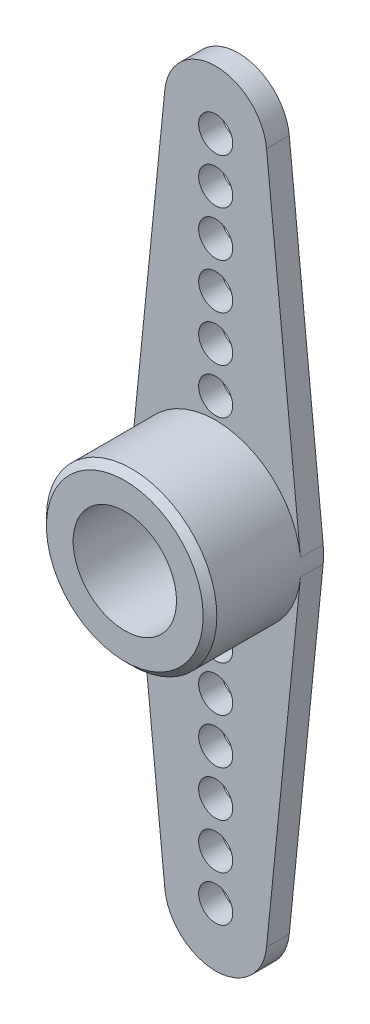
ISO-10303-21;
HEADER;
FILE_DESCRIPTION(('STEP AP214'),'2;1');
FILE_NAME('part.step','',(''),(''),'','','');
FILE_SCHEMA(('AUTOMOTIVE_DESIGN { 1 0 10303 214 1 1 1 1 }'));
ENDSEC;
DATA;
#1=APPLICATION_CONTEXT('core data for automotive mechanical design processes');
#2=APPLICATION_PROTOCOL_DEFINITION('international standard','automotive_design',2000,#1);
#3=PRODUCT_CONTEXT('',#1,'mechanical');
#4=PRODUCT('Part','Part','',(#3));
#5=PRODUCT_RELATED_PRODUCT_CATEGORY('part','',(#4));
#6=PRODUCT_DEFINITION_FORMATION('','',#4);
#7=PRODUCT_DEFINITION_CONTEXT('part definition',#1,'design');
#8=PRODUCT_DEFINITION('design','',#6,#7);
#9=PRODUCT_DEFINITION_SHAPE('','',#8);
#10=(LENGTH_UNIT() NAMED_UNIT(*) SI_UNIT(.MILLI.,.METRE.));
#11=(NAMED_UNIT(*) PLANE_ANGLE_UNIT() SI_UNIT($,.RADIAN.));
#12=(NAMED_UNIT(*) SI_UNIT($,.STERADIAN.) SOLID_ANGLE_UNIT());
#13=UNCERTAINTY_MEASURE_WITH_UNIT(LENGTH_MEASURE(1.E-05),#10,'distance_accuracy_value','');
#14=(GEOMETRIC_REPRESENTATION_CONTEXT(3) GLOBAL_UNCERTAINTY_ASSIGNED_CONTEXT((#13)) GLOBAL_UNIT_ASSIGNED_CONTEXT((#10,
#11,#12)) REPRESENTATION_CONTEXT('',''));
#15=CARTESIAN_POINT('',(0.,0.,0.));
#16=DIRECTION('',(0.,0.,1.));
#17=DIRECTION('',(1.,0.,0.));
#18=AXIS2_PLACEMENT_3D('',#15,#16,#17);
#19=CARTESIAN_POINT('',(0.,15.,1.));
#20=DIRECTION('',(0.,0.,-1.));
#21=DIRECTION('',(-1.,0.,0.));
#22=AXIS2_PLACEMENT_3D('',#19,#20,#21);
#23=CYLINDRICAL_SURFACE('',#22,2.25);
#24=CARTESIAN_POINT('',(0.,15.,0.));
#25=DIRECTION('',(0.,0.,1.));
#26=DIRECTION('',(1.,0.,0.));
#27=AXIS2_PLACEMENT_3D('',#24,#25,#26);
#28=CIRCLE('',#27,2.25);
#29=CARTESIAN_POINT('',(2.23872173348989,15.225,0.));
#30=VERTEX_POINT('',#29);
#31=CARTESIAN_POINT('',(-2.23872173348989,15.225,0.));
#32=VERTEX_POINT('',#31);
#33=EDGE_CURVE('E219',#30,#32,#28,.T.);
#34=ORIENTED_EDGE('',*,*,#33,.T.);
#35=DIRECTION('',(0.,0.,-1.));
#36=VECTOR('',#35,1.);
#37=CARTESIAN_POINT('',(-2.23872173348989,15.225,1.));
#38=LINE('',#37,#36);
#39=CARTESIAN_POINT('',(-2.23872173348989,15.225,1.));
#40=VERTEX_POINT('',#39);
#41=EDGE_CURVE('E225',#40,#32,#38,.T.);
#42=ORIENTED_EDGE('',*,*,#41,.F.);
#43=CARTESIAN_POINT('',(0.,15.,1.));
#44=DIRECTION('',(0.,0.,1.));
#45=DIRECTION('',(1.,0.,0.));
#46=AXIS2_PLACEMENT_3D('',#43,#44,#45);
#47=CIRCLE('',#46,2.25);
#48=CARTESIAN_POINT('',(2.23872173348989,15.225,1.));
#49=VERTEX_POINT('',#48);
#50=EDGE_CURVE('E220',#49,#40,#47,.T.);
#51=ORIENTED_EDGE('',*,*,#50,.F.);
#52=DIRECTION('',(0.,0.,-1.));
#53=VECTOR('',#52,1.);
#54=CARTESIAN_POINT('',(2.23872173348989,15.225,1.));
#55=LINE('',#54,#53);
#56=EDGE_CURVE('E228',#49,#30,#55,.T.);
#57=ORIENTED_EDGE('',*,*,#56,.T.);
#58=EDGE_LOOP('',(#34,#42,#51,#57));
#59=FACE_BOUND('',#58,.T.);
#60=ADVANCED_FACE('F37',(#59),#23,.T.);
#61=CARTESIAN_POINT('',(-2.23872173348989,15.225,1.));
#62=DIRECTION('',(0.99498743710662,-0.1,0.));
#63=DIRECTION('',(0.1,0.99498743710662,0.));
#64=AXIS2_PLACEMENT_3D('',#61,#62,#63);
#65=PLANE('',#64);
#66=DIRECTION('',(-0.1,-0.99498743710662,0.));
#67=VECTOR('',#66,1.);
#68=CARTESIAN_POINT('',(-2.23872173348989,15.225,0.));
#69=LINE('',#68,#67);
#70=CARTESIAN_POINT('',(-3.73120288914983,0.375,0.));
#71=VERTEX_POINT('',#70);
#72=EDGE_CURVE('E248',#32,#71,#69,.T.);
#73=ORIENTED_EDGE('',*,*,#72,.T.);
#74=DIRECTION('',(0.,0.,-1.));
#75=VECTOR('',#74,1.);
#76=CARTESIAN_POINT('',(-3.73120288914983,0.375,1.));
#77=LINE('',#76,#75);
#78=CARTESIAN_POINT('',(-3.73120288914983,0.375,1.));
#79=VERTEX_POINT('',#78);
#80=EDGE_CURVE('E233',#79,#71,#77,.T.);
#81=ORIENTED_EDGE('',*,*,#80,.F.);
#82=DIRECTION('',(-0.1,-0.99498743710662,0.));
#83=VECTOR('',#82,1.);
#84=CARTESIAN_POINT('',(-2.23872173348989,15.225,1.));
#85=LINE('',#84,#83);
#86=EDGE_CURVE('E84',#40,#79,#85,.T.);
#87=ORIENTED_EDGE('',*,*,#86,.F.);
#88=ORIENTED_EDGE('',*,*,#41,.T.);
#89=EDGE_LOOP('',(#73,#81,#87,#88));
#90=FACE_BOUND('',#89,.T.);
#91=ADVANCED_FACE('F247',(#90),#65,.F.);
#92=CARTESIAN_POINT('',(0.,0.,1.));
#93=DIRECTION('',(0.,0.,-1.));
#94=DIRECTION('',(-1.,0.,0.));
#95=AXIS2_PLACEMENT_3D('',#92,#93,#94);
#96=CYLINDRICAL_SURFACE('',#95,3.75);
#97=CARTESIAN_POINT('',(0.,0.,4.7));
#98=DIRECTION('',(0.,0.,1.));
#99=DIRECTION('',(1.,0.,0.));
#100=AXIS2_PLACEMENT_3D('',#97,#98,#99);
#101=CIRCLE('',#100,3.75);
#102=CARTESIAN_POINT('',(3.75,0.,4.7));
#103=VERTEX_POINT('',#102);
#104=EDGE_CURVE('E11',#103,#103,#101,.F.);
#105=ORIENTED_EDGE('',*,*,#104,.T.);
#106=EDGE_LOOP('',(#105));
#107=FACE_BOUND('',#106,.T.);
#108=CARTESIAN_POINT('',(0.,0.,0.));
#109=DIRECTION('',(0.,0.,1.));
#110=DIRECTION('',(1.,0.,0.));
#111=AXIS2_PLACEMENT_3D('',#108,#109,#110);
#112=CIRCLE('',#111,3.75);
#113=CARTESIAN_POINT('',(-3.73120288914983,-0.375,0.));
#114=VERTEX_POINT('',#113);
#115=EDGE_CURVE('E255',#71,#114,#112,.T.);
#116=ORIENTED_EDGE('',*,*,#115,.T.);
#117=DIRECTION('',(0.,0.,-1.));
#118=VECTOR('',#117,1.);
#119=CARTESIAN_POINT('',(-3.73120288914983,-0.375,1.));
#120=LINE('',#119,#118);
#121=CARTESIAN_POINT('',(-3.73120288914983,-0.375,1.));
#122=VERTEX_POINT('',#121);
#123=EDGE_CURVE('E129',#122,#114,#120,.T.);
#124=ORIENTED_EDGE('',*,*,#123,.F.);
#125=CARTESIAN_POINT('',(0.,0.,1.));
#126=DIRECTION('',(0.,0.,-1.));
#127=DIRECTION('',(1.,0.,0.));
#128=AXIS2_PLACEMENT_3D('',#125,#126,#127);
#129=CIRCLE('',#128,3.75);
#130=CARTESIAN_POINT('',(3.73120288914983,-0.375,1.));
#131=VERTEX_POINT('',#130);
#132=EDGE_CURVE('E115',#131,#122,#129,.T.);
#133=ORIENTED_EDGE('',*,*,#132,.F.);
#134=DIRECTION('',(0.,0.,-1.));
#135=VECTOR('',#134,1.);
#136=CARTESIAN_POINT('',(3.73120288914983,-0.375,1.));
#137=LINE('',#136,#135);
#138=CARTESIAN_POINT('',(3.73120288914983,-0.375,0.));
#139=VERTEX_POINT('',#138);
#140=EDGE_CURVE('E126',#131,#139,#137,.T.);
#141=ORIENTED_EDGE('',*,*,#140,.T.);
#142=CARTESIAN_POINT('',(3.73120288914983,0.375,0.));
#143=VERTEX_POINT('',#142);
#144=EDGE_CURVE('E73',#139,#143,#112,.T.);
#145=ORIENTED_EDGE('',*,*,#144,.T.);
#146=DIRECTION('',(0.,0.,-1.));
#147=VECTOR('',#146,1.);
#148=CARTESIAN_POINT('',(3.73120288914983,0.375,1.));
#149=LINE('',#148,#147);
#150=CARTESIAN_POINT('',(3.73120288914983,0.375,1.));
#151=VERTEX_POINT('',#150);
#152=EDGE_CURVE('E231',#151,#143,#149,.T.);
#153=ORIENTED_EDGE('',*,*,#152,.F.);
#154=CARTESIAN_POINT('',(0.,0.,1.));
#155=DIRECTION('',(0.,0.,1.));
#156=DIRECTION('',(1.,0.,0.));
#157=AXIS2_PLACEMENT_3D('',#154,#155,#156);
#158=CIRCLE('',#157,3.75);
#159=EDGE_CURVE('E213',#151,#79,#158,.T.);
#160=ORIENTED_EDGE('',*,*,#159,.T.);
#161=ORIENTED_EDGE('',*,*,#80,.T.);
#162=EDGE_LOOP('',(#116,#124,#133,#141,#145,#153,#160,#161));
#163=FACE_BOUND('',#162,.T.);
#164=ADVANCED_FACE('F131',(#107,#163),#96,.T.);
#165=CARTESIAN_POINT('',(2.23872173348989,15.225,1.));
#166=DIRECTION('',(-0.99498743710662,-0.1,0.));
#167=DIRECTION('',(0.1,-0.99498743710662,0.));
#168=AXIS2_PLACEMENT_3D('',#165,#166,#167);
#169=PLANE('',#168);
#170=DIRECTION('',(-0.1,0.99498743710662,0.));
#171=VECTOR('',#170,1.);
#172=CARTESIAN_POINT('',(2.23872173348989,15.225,0.));
#173=LINE('',#172,#171);
#174=EDGE_CURVE('E78',#143,#30,#173,.T.);
#175=ORIENTED_EDGE('',*,*,#174,.T.);
#176=ORIENTED_EDGE('',*,*,#56,.F.);
#177=DIRECTION('',(-0.1,0.99498743710662,0.));
#178=VECTOR('',#177,1.);
#179=CARTESIAN_POINT('',(2.23872173348989,15.225,1.));
#180=LINE('',#179,#178);
#181=EDGE_CURVE('E54',#151,#49,#180,.T.);
#182=ORIENTED_EDGE('',*,*,#181,.F.);
#183=ORIENTED_EDGE('',*,*,#152,.T.);
#184=EDGE_LOOP('',(#175,#176,#182,#183));
#185=FACE_BOUND('',#184,.T.);
#186=ADVANCED_FACE('F259',(#185),#169,.F.);
#187=CARTESIAN_POINT('',(0.,15.,1.));
#188=DIRECTION('',(0.,0.,1.));
#189=DIRECTION('',(1.,0.,0.));
#190=AXIS2_PLACEMENT_3D('',#187,#188,#189);
#191=PLANE('',#190);
#192=CARTESIAN_POINT('',(0.,14.6722294535393,1.));
#193=DIRECTION('',(0.,0.,1.));
#194=DIRECTION('',(1.,0.,0.));
#195=AXIS2_PLACEMENT_3D('',#192,#193,#194);
#196=CIRCLE('',#195,0.75);
#197=CARTESIAN_POINT('',(0.750000000000035,14.6722294535393,1.));
#198=VERTEX_POINT('',#197);
#199=EDGE_CURVE('E164',#198,#198,#196,.T.);
#200=ORIENTED_EDGE('',*,*,#199,.F.);
#201=EDGE_LOOP('',(#200));
#202=FACE_BOUND('',#201,.T.);
#203=CARTESIAN_POINT('',(0.,12.6722294535393,1.));
#204=DIRECTION('',(0.,0.,1.));
#205=DIRECTION('',(1.,0.,0.));
#206=AXIS2_PLACEMENT_3D('',#203,#204,#205);
#207=CIRCLE('',#206,0.75);
#208=CARTESIAN_POINT('',(0.750000000000028,12.6722294535393,1.));
#209=VERTEX_POINT('',#208);
#210=EDGE_CURVE('E170',#209,#209,#207,.T.);
#211=ORIENTED_EDGE('',*,*,#210,.F.);
#212=EDGE_LOOP('',(#211));
#213=FACE_BOUND('',#212,.T.);
#214=CARTESIAN_POINT('',(0.,10.6722294535393,1.));
#215=DIRECTION('',(0.,0.,1.));
#216=DIRECTION('',(1.,0.,0.));
#217=AXIS2_PLACEMENT_3D('',#214,#215,#216);
#218=CIRCLE('',#217,0.75);
#219=CARTESIAN_POINT('',(0.750000000000021,10.6722294535393,1.));
#220=VERTEX_POINT('',#219);
#221=EDGE_CURVE('E176',#220,#220,#218,.T.);
#222=ORIENTED_EDGE('',*,*,#221,.F.);
#223=EDGE_LOOP('',(#222));
#224=FACE_BOUND('',#223,.T.);
#225=CARTESIAN_POINT('',(0.,8.6722294535393,1.));
#226=DIRECTION('',(0.,0.,1.));
#227=DIRECTION('',(1.,0.,0.));
#228=AXIS2_PLACEMENT_3D('',#225,#226,#227);
#229=CIRCLE('',#228,0.75);
#230=CARTESIAN_POINT('',(0.750000000000014,8.6722294535393,1.));
#231=VERTEX_POINT('',#230);
#232=EDGE_CURVE('E182',#231,#231,#229,.T.);
#233=ORIENTED_EDGE('',*,*,#232,.F.);
#234=EDGE_LOOP('',(#233));
#235=FACE_BOUND('',#234,.T.);
#236=CARTESIAN_POINT('',(0.,6.6722294535393,1.));
#237=DIRECTION('',(0.,0.,1.));
#238=DIRECTION('',(1.,0.,0.));
#239=AXIS2_PLACEMENT_3D('',#236,#237,#238);
#240=CIRCLE('',#239,0.75);
#241=CARTESIAN_POINT('',(0.750000000000007,6.6722294535393,1.));
#242=VERTEX_POINT('',#241);
#243=EDGE_CURVE('E188',#242,#242,#240,.T.);
#244=ORIENTED_EDGE('',*,*,#243,.F.);
#245=EDGE_LOOP('',(#244));
#246=FACE_BOUND('',#245,.T.);
#247=CARTESIAN_POINT('',(0.,4.6722294535393,1.));
#248=DIRECTION('',(0.,0.,1.));
#249=DIRECTION('',(1.,0.,0.));
#250=AXIS2_PLACEMENT_3D('',#247,#248,#249);
#251=CIRCLE('',#250,0.75);
#252=CARTESIAN_POINT('',(0.75,4.6722294535393,1.));
#253=VERTEX_POINT('',#252);
#254=EDGE_CURVE('E194',#253,#253,#251,.T.);
#255=ORIENTED_EDGE('',*,*,#254,.F.);
#256=EDGE_LOOP('',(#255));
#257=FACE_BOUND('',#256,.T.);
#258=ORIENTED_EDGE('',*,*,#159,.F.);
#259=ORIENTED_EDGE('',*,*,#181,.T.);
#260=ORIENTED_EDGE('',*,*,#50,.T.);
#261=ORIENTED_EDGE('',*,*,#86,.T.);
#262=EDGE_LOOP('',(#258,#259,#260,#261));
#263=FACE_BOUND('',#262,.T.);
#264=ADVANCED_FACE('F257',(#202,#213,#224,#235,#246,#257,#263),#191,.T.);
#265=CARTESIAN_POINT('',(0.,15.,0.));
#266=DIRECTION('',(0.,0.,1.));
#267=DIRECTION('',(1.,0.,0.));
#268=AXIS2_PLACEMENT_3D('',#265,#266,#267);
#269=PLANE('',#268);
#270=CARTESIAN_POINT('',(0.,0.,0.));
#271=DIRECTION('',(0.,0.,-1.));
#272=DIRECTION('',(-1.,0.,0.));
#273=AXIS2_PLACEMENT_3D('',#270,#271,#272);
#274=CIRCLE('',#273,2.);
#275=CARTESIAN_POINT('',(-2.,0.,0.));
#276=VERTEX_POINT('',#275);
#277=EDGE_CURVE('E203',#276,#276,#274,.T.);
#278=ORIENTED_EDGE('',*,*,#277,.F.);
#279=EDGE_LOOP('',(#278));
#280=FACE_BOUND('',#279,.T.);
#281=CARTESIAN_POINT('',(0.,14.6722294535393,0.));
#282=DIRECTION('',(0.,0.,-1.));
#283=DIRECTION('',(-1.,0.,0.));
#284=AXIS2_PLACEMENT_3D('',#281,#282,#283);
#285=CIRCLE('',#284,0.75);
#286=CARTESIAN_POINT('',(-0.749999999999965,14.6722294535393,0.));
#287=VERTEX_POINT('',#286);
#288=EDGE_CURVE('E161',#287,#287,#285,.T.);
#289=ORIENTED_EDGE('',*,*,#288,.F.);
#290=EDGE_LOOP('',(#289));
#291=FACE_BOUND('',#290,.T.);
#292=CARTESIAN_POINT('',(0.,12.6722294535393,0.));
#293=DIRECTION('',(0.,0.,-1.));
#294=DIRECTION('',(-1.,0.,0.));
#295=AXIS2_PLACEMENT_3D('',#292,#293,#294);
#296=CIRCLE('',#295,0.75);
#297=CARTESIAN_POINT('',(-0.749999999999972,12.6722294535393,0.));
#298=VERTEX_POINT('',#297);
#299=EDGE_CURVE('E167',#298,#298,#296,.T.);
#300=ORIENTED_EDGE('',*,*,#299,.F.);
#301=EDGE_LOOP('',(#300));
#302=FACE_BOUND('',#301,.T.);
#303=CARTESIAN_POINT('',(0.,10.6722294535393,0.));
#304=DIRECTION('',(0.,0.,-1.));
#305=DIRECTION('',(-1.,0.,0.));
#306=AXIS2_PLACEMENT_3D('',#303,#304,#305);
#307=CIRCLE('',#306,0.75);
#308=CARTESIAN_POINT('',(-0.749999999999979,10.6722294535393,0.));
#309=VERTEX_POINT('',#308);
#310=EDGE_CURVE('E173',#309,#309,#307,.T.);
#311=ORIENTED_EDGE('',*,*,#310,.F.);
#312=EDGE_LOOP('',(#311));
#313=FACE_BOUND('',#312,.T.);
#314=CARTESIAN_POINT('',(0.,8.6722294535393,0.));
#315=DIRECTION('',(0.,0.,-1.));
#316=DIRECTION('',(-1.,0.,0.));
#317=AXIS2_PLACEMENT_3D('',#314,#315,#316);
#318=CIRCLE('',#317,0.75);
#319=CARTESIAN_POINT('',(-0.749999999999986,8.6722294535393,0.));
#320=VERTEX_POINT('',#319);
#321=EDGE_CURVE('E179',#320,#320,#318,.T.);
#322=ORIENTED_EDGE('',*,*,#321,.F.);
#323=EDGE_LOOP('',(#322));
#324=FACE_BOUND('',#323,.T.);
#325=CARTESIAN_POINT('',(0.,6.6722294535393,0.));
#326=DIRECTION('',(0.,0.,-1.));
#327=DIRECTION('',(-1.,0.,0.));
#328=AXIS2_PLACEMENT_3D('',#325,#326,#327);
#329=CIRCLE('',#328,0.75);
#330=CARTESIAN_POINT('',(-0.749999999999993,6.6722294535393,0.));
#331=VERTEX_POINT('',#330);
#332=EDGE_CURVE('E185',#331,#331,#329,.T.);
#333=ORIENTED_EDGE('',*,*,#332,.F.);
#334=EDGE_LOOP('',(#333));
#335=FACE_BOUND('',#334,.T.);
#336=CARTESIAN_POINT('',(0.,4.6722294535393,0.));
#337=DIRECTION('',(0.,0.,-1.));
#338=DIRECTION('',(-1.,0.,0.));
#339=AXIS2_PLACEMENT_3D('',#336,#337,#338);
#340=CIRCLE('',#339,0.75);
#341=CARTESIAN_POINT('',(-0.75,4.6722294535393,0.));
#342=VERTEX_POINT('',#341);
#343=EDGE_CURVE('E191',#342,#342,#340,.T.);
#344=ORIENTED_EDGE('',*,*,#343,.F.);
#345=EDGE_LOOP('',(#344));
#346=FACE_BOUND('',#345,.T.);
#347=ORIENTED_EDGE('',*,*,#144,.F.);
#348=DIRECTION('',(-0.1,-0.99498743710662,0.));
#349=VECTOR('',#348,1.);
#350=CARTESIAN_POINT('',(2.23872173348989,-15.225,0.));
#351=LINE('',#350,#349);
#352=CARTESIAN_POINT('',(2.23872173348989,-15.225,0.));
#353=VERTEX_POINT('',#352);
#354=EDGE_CURVE('E128',#139,#353,#351,.T.);
#355=ORIENTED_EDGE('',*,*,#354,.T.);
#356=CARTESIAN_POINT('',(0.,-15.,0.));
#357=DIRECTION('',(0.,0.,-1.));
#358=DIRECTION('',(1.,0.,0.));
#359=AXIS2_PLACEMENT_3D('',#356,#357,#358);
#360=CIRCLE('',#359,2.25);
#361=CARTESIAN_POINT('',(-2.23872173348989,-15.225,0.));
#362=VERTEX_POINT('',#361);
#363=EDGE_CURVE('E134',#353,#362,#360,.T.);
#364=ORIENTED_EDGE('',*,*,#363,.T.);
#365=DIRECTION('',(-0.1,0.99498743710662,0.));
#366=VECTOR('',#365,1.);
#367=CARTESIAN_POINT('',(-2.23872173348989,-15.225,0.));
#368=LINE('',#367,#366);
#369=EDGE_CURVE('E138',#362,#114,#368,.T.);
#370=ORIENTED_EDGE('',*,*,#369,.T.);
#371=ORIENTED_EDGE('',*,*,#115,.F.);
#372=ORIENTED_EDGE('',*,*,#72,.F.);
#373=ORIENTED_EDGE('',*,*,#33,.F.);
#374=ORIENTED_EDGE('',*,*,#174,.F.);
#375=EDGE_LOOP('',(#347,#355,#364,#370,#371,#372,#373,#374));
#376=FACE_BOUND('',#375,.T.);
#377=CARTESIAN_POINT('',(0.,-14.6722294535393,0.));
#378=DIRECTION('',(0.,0.,1.));
#379=DIRECTION('',(-1.,0.,0.));
#380=AXIS2_PLACEMENT_3D('',#377,#378,#379);
#381=CIRCLE('',#380,0.75);
#382=CARTESIAN_POINT('',(-0.749999999999965,-14.6722294535393,0.));
#383=VERTEX_POINT('',#382);
#384=EDGE_CURVE('E474',#383,#383,#381,.T.);
#385=ORIENTED_EDGE('',*,*,#384,.T.);
#386=EDGE_LOOP('',(#385));
#387=FACE_BOUND('',#386,.T.);
#388=CARTESIAN_POINT('',(0.,-12.6722294535393,0.));
#389=DIRECTION('',(0.,0.,1.));
#390=DIRECTION('',(-1.,0.,0.));
#391=AXIS2_PLACEMENT_3D('',#388,#389,#390);
#392=CIRCLE('',#391,0.75);
#393=CARTESIAN_POINT('',(-0.749999999999972,-12.6722294535393,0.));
#394=VERTEX_POINT('',#393);
#395=EDGE_CURVE('E476',#394,#394,#392,.T.);
#396=ORIENTED_EDGE('',*,*,#395,.T.);
#397=EDGE_LOOP('',(#396));
#398=FACE_BOUND('',#397,.T.);
#399=CARTESIAN_POINT('',(0.,-10.6722294535393,0.));
#400=DIRECTION('',(0.,0.,1.));
#401=DIRECTION('',(-1.,0.,0.));
#402=AXIS2_PLACEMENT_3D('',#399,#400,#401);
#403=CIRCLE('',#402,0.75);
#404=CARTESIAN_POINT('',(-0.749999999999979,-10.6722294535393,0.));
#405=VERTEX_POINT('',#404);
#406=EDGE_CURVE('E484',#405,#405,#403,.T.);
#407=ORIENTED_EDGE('',*,*,#406,.T.);
#408=EDGE_LOOP('',(#407));
#409=FACE_BOUND('',#408,.T.);
#410=CARTESIAN_POINT('',(0.,-8.6722294535393,0.));
#411=DIRECTION('',(0.,0.,1.));
#412=DIRECTION('',(-1.,0.,0.));
#413=AXIS2_PLACEMENT_3D('',#410,#411,#412);
#414=CIRCLE('',#413,0.75);
#415=CARTESIAN_POINT('',(-0.749999999999986,-8.6722294535393,0.));
#416=VERTEX_POINT('',#415);
#417=EDGE_CURVE('E490',#416,#416,#414,.T.);
#418=ORIENTED_EDGE('',*,*,#417,.T.);
#419=EDGE_LOOP('',(#418));
#420=FACE_BOUND('',#419,.T.);
#421=CARTESIAN_POINT('',(0.,-6.6722294535393,0.));
#422=DIRECTION('',(0.,0.,1.));
#423=DIRECTION('',(-1.,0.,0.));
#424=AXIS2_PLACEMENT_3D('',#421,#422,#423);
#425=CIRCLE('',#424,0.75);
#426=CARTESIAN_POINT('',(-0.749999999999993,-6.6722294535393,0.));
#427=VERTEX_POINT('',#426);
#428=EDGE_CURVE('E496',#427,#427,#425,.T.);
#429=ORIENTED_EDGE('',*,*,#428,.T.);
#430=EDGE_LOOP('',(#429));
#431=FACE_BOUND('',#430,.T.);
#432=CARTESIAN_POINT('',(0.,-4.6722294535393,0.));
#433=DIRECTION('',(0.,0.,1.));
#434=DIRECTION('',(-1.,0.,0.));
#435=AXIS2_PLACEMENT_3D('',#432,#433,#434);
#436=CIRCLE('',#435,0.75);
#437=CARTESIAN_POINT('',(-0.75,-4.6722294535393,0.));
#438=VERTEX_POINT('',#437);
#439=EDGE_CURVE('E141',#438,#438,#436,.T.);
#440=ORIENTED_EDGE('',*,*,#439,.T.);
#441=EDGE_LOOP('',(#440));
#442=FACE_BOUND('',#441,.T.);
#443=ADVANCED_FACE('F260',(#280,#291,#302,#313,#324,#335,#346,#376,#387,#398,#409,#420,#431,
#442),#269,.F.);
#444=CARTESIAN_POINT('',(0.,0.,5.));
#445=DIRECTION('',(0.,0.,1.));
#446=DIRECTION('',(1.,0.,0.));
#447=AXIS2_PLACEMENT_3D('',#444,#445,#446);
#448=PLANE('',#447);
#449=CARTESIAN_POINT('',(0.,0.,5.));
#450=DIRECTION('',(0.,0.,1.));
#451=DIRECTION('',(1.,0.,0.));
#452=AXIS2_PLACEMENT_3D('',#449,#450,#451);
#453=CIRCLE('',#452,3.45);
#454=CARTESIAN_POINT('',(3.45,0.,5.));
#455=VERTEX_POINT('',#454);
#456=EDGE_CURVE('E46',#455,#455,#453,.T.);
#457=ORIENTED_EDGE('',*,*,#456,.T.);
#458=EDGE_LOOP('',(#457));
#459=FACE_BOUND('',#458,.T.);
#460=CARTESIAN_POINT('',(0.,0.,5.));
#461=DIRECTION('',(0.,0.,1.));
#462=DIRECTION('',(1.,0.,0.));
#463=AXIS2_PLACEMENT_3D('',#460,#461,#462);
#464=CIRCLE('',#463,2.275);
#465=CARTESIAN_POINT('',(2.275,0.,5.));
#466=VERTEX_POINT('',#465);
#467=EDGE_CURVE('E207',#466,#466,#464,.T.);
#468=ORIENTED_EDGE('',*,*,#467,.F.);
#469=EDGE_LOOP('',(#468));
#470=FACE_BOUND('',#469,.T.);
#471=ADVANCED_FACE('F293',(#459,#470),#448,.T.);
#472=CARTESIAN_POINT('',(0.,0.,1.5));
#473=DIRECTION('',(0.,0.,1.));
#474=DIRECTION('',(1.,0.,0.));
#475=AXIS2_PLACEMENT_3D('',#472,#473,#474);
#476=CYLINDRICAL_SURFACE('',#475,2.275);
#477=CARTESIAN_POINT('',(0.,0.,1.5));
#478=DIRECTION('',(0.,0.,1.));
#479=DIRECTION('',(1.,0.,0.));
#480=AXIS2_PLACEMENT_3D('',#477,#478,#479);
#481=CIRCLE('',#480,2.275);
#482=CARTESIAN_POINT('',(2.275,0.,1.5));
#483=VERTEX_POINT('',#482);
#484=EDGE_CURVE('E210',#483,#483,#481,.T.);
#485=ORIENTED_EDGE('',*,*,#484,.F.);
#486=EDGE_LOOP('',(#485));
#487=FACE_BOUND('',#486,.T.);
#488=ORIENTED_EDGE('',*,*,#467,.T.);
#489=EDGE_LOOP('',(#488));
#490=FACE_BOUND('',#489,.T.);
#491=ADVANCED_FACE('F300',(#487,#490),#476,.F.);
#492=CARTESIAN_POINT('',(0.,0.,1.5));
#493=DIRECTION('',(0.,0.,1.));
#494=DIRECTION('',(1.,0.,0.));
#495=AXIS2_PLACEMENT_3D('',#492,#493,#494);
#496=PLANE('',#495);
#497=ORIENTED_EDGE('',*,*,#484,.T.);
#498=EDGE_LOOP('',(#497));
#499=FACE_BOUND('',#498,.T.);
#500=CARTESIAN_POINT('',(0.,0.,1.5));
#501=DIRECTION('',(0.,0.,1.));
#502=DIRECTION('',(1.,0.,0.));
#503=AXIS2_PLACEMENT_3D('',#500,#501,#502);
#504=CIRCLE('',#503,0.75);
#505=CARTESIAN_POINT('',(0.75,0.,1.5));
#506=VERTEX_POINT('',#505);
#507=EDGE_CURVE('E200',#506,#506,#504,.T.);
#508=ORIENTED_EDGE('',*,*,#507,.F.);
#509=EDGE_LOOP('',(#508));
#510=FACE_BOUND('',#509,.T.);
#511=ADVANCED_FACE('F303',(#499,#510),#496,.T.);
#512=CARTESIAN_POINT('',(0.,0.,0.8));
#513=DIRECTION('',(0.,0.,-1.));
#514=DIRECTION('',(-1.,0.,0.));
#515=AXIS2_PLACEMENT_3D('',#512,#513,#514);
#516=CYLINDRICAL_SURFACE('',#515,2.);
#517=ORIENTED_EDGE('',*,*,#277,.T.);
#518=EDGE_LOOP('',(#517));
#519=FACE_BOUND('',#518,.T.);
#520=CARTESIAN_POINT('',(0.,0.,0.8));
#521=DIRECTION('',(0.,0.,-1.));
#522=DIRECTION('',(-1.,0.,0.));
#523=AXIS2_PLACEMENT_3D('',#520,#521,#522);
#524=CIRCLE('',#523,2.);
#525=CARTESIAN_POINT('',(-2.,0.,0.8));
#526=VERTEX_POINT('',#525);
#527=EDGE_CURVE('E204',#526,#526,#524,.T.);
#528=ORIENTED_EDGE('',*,*,#527,.F.);
#529=EDGE_LOOP('',(#528));
#530=FACE_BOUND('',#529,.T.);
#531=ADVANCED_FACE('F307',(#519,#530),#516,.F.);
#532=CARTESIAN_POINT('',(0.,0.,0.8));
#533=DIRECTION('',(0.,0.,-1.));
#534=DIRECTION('',(-1.,0.,0.));
#535=AXIS2_PLACEMENT_3D('',#532,#533,#534);
#536=PLANE('',#535);
#537=CARTESIAN_POINT('',(0.,0.,0.8));
#538=DIRECTION('',(0.,0.,-1.));
#539=DIRECTION('',(-1.,0.,0.));
#540=AXIS2_PLACEMENT_3D('',#537,#538,#539);
#541=CIRCLE('',#540,0.75);
#542=CARTESIAN_POINT('',(-0.75,0.,0.8));
#543=VERTEX_POINT('',#542);
#544=EDGE_CURVE('E197',#543,#543,#541,.T.);
#545=ORIENTED_EDGE('',*,*,#544,.F.);
#546=EDGE_LOOP('',(#545));
#547=FACE_BOUND('',#546,.T.);
#548=ORIENTED_EDGE('',*,*,#527,.T.);
#549=EDGE_LOOP('',(#548));
#550=FACE_BOUND('',#549,.T.);
#551=ADVANCED_FACE('F311',(#547,#550),#536,.T.);
#552=CARTESIAN_POINT('',(0.,0.,5.6));
#553=DIRECTION('',(0.,0.,-1.));
#554=DIRECTION('',(-1.,0.,0.));
#555=AXIS2_PLACEMENT_3D('',#552,#553,#554);
#556=CYLINDRICAL_SURFACE('',#555,0.75);
#557=ORIENTED_EDGE('',*,*,#544,.T.);
#558=EDGE_LOOP('',(#557));
#559=FACE_BOUND('',#558,.T.);
#560=ORIENTED_EDGE('',*,*,#507,.T.);
#561=EDGE_LOOP('',(#560));
#562=FACE_BOUND('',#561,.T.);
#563=ADVANCED_FACE('F315',(#559,#562),#556,.F.);
#564=CARTESIAN_POINT('',(0.,4.6722294535393,4.8));
#565=DIRECTION('',(0.,0.,-1.));
#566=DIRECTION('',(-1.,0.,0.));
#567=AXIS2_PLACEMENT_3D('',#564,#565,#566);
#568=CYLINDRICAL_SURFACE('',#567,0.75);
#569=ORIENTED_EDGE('',*,*,#254,.T.);
#570=EDGE_LOOP('',(#569));
#571=FACE_BOUND('',#570,.T.);
#572=ORIENTED_EDGE('',*,*,#343,.T.);
#573=EDGE_LOOP('',(#572));
#574=FACE_BOUND('',#573,.T.);
#575=ADVANCED_FACE('F319',(#571,#574),#568,.F.);
#576=CARTESIAN_POINT('',(0.,6.6722294535393,4.8));
#577=DIRECTION('',(0.,0.,-1.));
#578=DIRECTION('',(-1.,0.,0.));
#579=AXIS2_PLACEMENT_3D('',#576,#577,#578);
#580=CYLINDRICAL_SURFACE('',#579,0.75);
#581=ORIENTED_EDGE('',*,*,#243,.T.);
#582=EDGE_LOOP('',(#581));
#583=FACE_BOUND('',#582,.T.);
#584=ORIENTED_EDGE('',*,*,#332,.T.);
#585=EDGE_LOOP('',(#584));
#586=FACE_BOUND('',#585,.T.);
#587=ADVANCED_FACE('F323',(#583,#586),#580,.F.);
#588=CARTESIAN_POINT('',(0.,8.6722294535393,4.8));
#589=DIRECTION('',(0.,0.,-1.));
#590=DIRECTION('',(-1.,0.,0.));
#591=AXIS2_PLACEMENT_3D('',#588,#589,#590);
#592=CYLINDRICAL_SURFACE('',#591,0.75);
#593=ORIENTED_EDGE('',*,*,#232,.T.);
#594=EDGE_LOOP('',(#593));
#595=FACE_BOUND('',#594,.T.);
#596=ORIENTED_EDGE('',*,*,#321,.T.);
#597=EDGE_LOOP('',(#596));
#598=FACE_BOUND('',#597,.T.);
#599=ADVANCED_FACE('F327',(#595,#598),#592,.F.);
#600=CARTESIAN_POINT('',(0.,10.6722294535393,4.8));
#601=DIRECTION('',(0.,0.,-1.));
#602=DIRECTION('',(-1.,0.,0.));
#603=AXIS2_PLACEMENT_3D('',#600,#601,#602);
#604=CYLINDRICAL_SURFACE('',#603,0.75);
#605=ORIENTED_EDGE('',*,*,#221,.T.);
#606=EDGE_LOOP('',(#605));
#607=FACE_BOUND('',#606,.T.);
#608=ORIENTED_EDGE('',*,*,#310,.T.);
#609=EDGE_LOOP('',(#608));
#610=FACE_BOUND('',#609,.T.);
#611=ADVANCED_FACE('F331',(#607,#610),#604,.F.);
#612=CARTESIAN_POINT('',(0.,12.6722294535393,4.8));
#613=DIRECTION('',(0.,0.,-1.));
#614=DIRECTION('',(-1.,0.,0.));
#615=AXIS2_PLACEMENT_3D('',#612,#613,#614);
#616=CYLINDRICAL_SURFACE('',#615,0.75);
#617=ORIENTED_EDGE('',*,*,#210,.T.);
#618=EDGE_LOOP('',(#617));
#619=FACE_BOUND('',#618,.T.);
#620=ORIENTED_EDGE('',*,*,#299,.T.);
#621=EDGE_LOOP('',(#620));
#622=FACE_BOUND('',#621,.T.);
#623=ADVANCED_FACE('F335',(#619,#622),#616,.F.);
#624=CARTESIAN_POINT('',(0.,14.6722294535393,4.8));
#625=DIRECTION('',(0.,0.,-1.));
#626=DIRECTION('',(-1.,0.,0.));
#627=AXIS2_PLACEMENT_3D('',#624,#625,#626);
#628=CYLINDRICAL_SURFACE('',#627,0.75);
#629=ORIENTED_EDGE('',*,*,#199,.T.);
#630=EDGE_LOOP('',(#629));
#631=FACE_BOUND('',#630,.T.);
#632=ORIENTED_EDGE('',*,*,#288,.T.);
#633=EDGE_LOOP('',(#632));
#634=FACE_BOUND('',#633,.T.);
#635=ADVANCED_FACE('F339',(#631,#634),#628,.F.);
#636=CARTESIAN_POINT('',(0.,0.,5.));
#637=DIRECTION('',(0.,0.,-1.));
#638=DIRECTION('',(-1.,0.,0.));
#639=AXIS2_PLACEMENT_3D('',#636,#637,#638);
#640=CONICAL_SURFACE('',#639,3.45,0.785398163397451);
#641=ORIENTED_EDGE('',*,*,#104,.F.);
#642=EDGE_LOOP('',(#641));
#643=FACE_BOUND('',#642,.T.);
#644=ORIENTED_EDGE('',*,*,#456,.F.);
#645=EDGE_LOOP('',(#644));
#646=FACE_BOUND('',#645,.T.);
#647=ADVANCED_FACE('F39',(#643,#646),#640,.T.);
#648=CARTESIAN_POINT('',(0.,-15.,1.));
#649=DIRECTION('',(0.,0.,-1.));
#650=DIRECTION('',(-1.,0.,0.));
#651=AXIS2_PLACEMENT_3D('',#648,#649,#650);
#652=CYLINDRICAL_SURFACE('',#651,2.25);
#653=ORIENTED_EDGE('',*,*,#363,.F.);
#654=DIRECTION('',(0.,0.,-1.));
#655=VECTOR('',#654,1.);
#656=CARTESIAN_POINT('',(2.23872173348989,-15.225,1.));
#657=LINE('',#656,#655);
#658=CARTESIAN_POINT('',(2.23872173348989,-15.225,1.));
#659=VERTEX_POINT('',#658);
#660=EDGE_CURVE('E122',#659,#353,#657,.T.);
#661=ORIENTED_EDGE('',*,*,#660,.F.);
#662=CARTESIAN_POINT('',(0.,-15.,1.));
#663=DIRECTION('',(0.,0.,-1.));
#664=DIRECTION('',(1.,0.,0.));
#665=AXIS2_PLACEMENT_3D('',#662,#663,#664);
#666=CIRCLE('',#665,2.25);
#667=CARTESIAN_POINT('',(-2.23872173348989,-15.225,1.));
#668=VERTEX_POINT('',#667);
#669=EDGE_CURVE('E118',#659,#668,#666,.T.);
#670=ORIENTED_EDGE('',*,*,#669,.T.);
#671=DIRECTION('',(0.,0.,-1.));
#672=VECTOR('',#671,1.);
#673=CARTESIAN_POINT('',(-2.23872173348989,-15.225,1.));
#674=LINE('',#673,#672);
#675=EDGE_CURVE('E148',#668,#362,#674,.T.);
#676=ORIENTED_EDGE('',*,*,#675,.T.);
#677=EDGE_LOOP('',(#653,#661,#670,#676));
#678=FACE_BOUND('',#677,.T.);
#679=ADVANCED_FACE('F267',(#678),#652,.T.);
#680=CARTESIAN_POINT('',(-2.23872173348989,-15.225,1.));
#681=DIRECTION('',(0.99498743710662,0.1,0.));
#682=DIRECTION('',(0.1,-0.99498743710662,0.));
#683=AXIS2_PLACEMENT_3D('',#680,#681,#682);
#684=PLANE('',#683);
#685=ORIENTED_EDGE('',*,*,#369,.F.);
#686=ORIENTED_EDGE('',*,*,#675,.F.);
#687=DIRECTION('',(-0.1,0.99498743710662,0.));
#688=VECTOR('',#687,1.);
#689=CARTESIAN_POINT('',(-2.23872173348989,-15.225,1.));
#690=LINE('',#689,#688);
#691=EDGE_CURVE('E123',#668,#122,#690,.T.);
#692=ORIENTED_EDGE('',*,*,#691,.T.);
#693=ORIENTED_EDGE('',*,*,#123,.T.);
#694=EDGE_LOOP('',(#685,#686,#692,#693));
#695=FACE_BOUND('',#694,.T.);
#696=ADVANCED_FACE('F270',(#695),#684,.F.);
#697=CARTESIAN_POINT('',(2.23872173348989,-15.225,1.));
#698=DIRECTION('',(-0.99498743710662,0.1,0.));
#699=DIRECTION('',(0.1,0.99498743710662,0.));
#700=AXIS2_PLACEMENT_3D('',#697,#698,#699);
#701=PLANE('',#700);
#702=ORIENTED_EDGE('',*,*,#354,.F.);
#703=ORIENTED_EDGE('',*,*,#140,.F.);
#704=DIRECTION('',(-0.1,-0.99498743710662,0.));
#705=VECTOR('',#704,1.);
#706=CARTESIAN_POINT('',(2.23872173348989,-15.225,1.));
#707=LINE('',#706,#705);
#708=EDGE_CURVE('E111',#131,#659,#707,.T.);
#709=ORIENTED_EDGE('',*,*,#708,.T.);
#710=ORIENTED_EDGE('',*,*,#660,.T.);
#711=EDGE_LOOP('',(#702,#703,#709,#710));
#712=FACE_BOUND('',#711,.T.);
#713=ADVANCED_FACE('F127',(#712),#701,.F.);
#714=CARTESIAN_POINT('',(0.,-15.,1.));
#715=DIRECTION('',(0.,0.,1.));
#716=DIRECTION('',(1.,0.,0.));
#717=AXIS2_PLACEMENT_3D('',#714,#715,#716);
#718=PLANE('',#717);
#719=CARTESIAN_POINT('',(0.,-14.6722294535393,1.));
#720=DIRECTION('',(0.,0.,-1.));
#721=DIRECTION('',(1.,0.,0.));
#722=AXIS2_PLACEMENT_3D('',#719,#720,#721);
#723=CIRCLE('',#722,0.75);
#724=CARTESIAN_POINT('',(0.750000000000035,-14.6722294535393,1.));
#725=VERTEX_POINT('',#724);
#726=EDGE_CURVE('E471',#725,#725,#723,.T.);
#727=ORIENTED_EDGE('',*,*,#726,.T.);
#728=EDGE_LOOP('',(#727));
#729=FACE_BOUND('',#728,.T.);
#730=CARTESIAN_POINT('',(0.,-12.6722294535393,1.));
#731=DIRECTION('',(0.,0.,-1.));
#732=DIRECTION('',(1.,0.,0.));
#733=AXIS2_PLACEMENT_3D('',#730,#731,#732);
#734=CIRCLE('',#733,0.75);
#735=CARTESIAN_POINT('',(0.750000000000028,-12.6722294535393,1.));
#736=VERTEX_POINT('',#735);
#737=EDGE_CURVE('E481',#736,#736,#734,.T.);
#738=ORIENTED_EDGE('',*,*,#737,.T.);
#739=EDGE_LOOP('',(#738));
#740=FACE_BOUND('',#739,.T.);
#741=CARTESIAN_POINT('',(0.,-10.6722294535393,1.));
#742=DIRECTION('',(0.,0.,-1.));
#743=DIRECTION('',(1.,0.,0.));
#744=AXIS2_PLACEMENT_3D('',#741,#742,#743);
#745=CIRCLE('',#744,0.75);
#746=CARTESIAN_POINT('',(0.750000000000021,-10.6722294535393,1.));
#747=VERTEX_POINT('',#746);
#748=EDGE_CURVE('E487',#747,#747,#745,.T.);
#749=ORIENTED_EDGE('',*,*,#748,.T.);
#750=EDGE_LOOP('',(#749));
#751=FACE_BOUND('',#750,.T.);
#752=CARTESIAN_POINT('',(0.,-8.6722294535393,1.));
#753=DIRECTION('',(0.,0.,-1.));
#754=DIRECTION('',(1.,0.,0.));
#755=AXIS2_PLACEMENT_3D('',#752,#753,#754);
#756=CIRCLE('',#755,0.75);
#757=CARTESIAN_POINT('',(0.750000000000014,-8.6722294535393,1.));
#758=VERTEX_POINT('',#757);
#759=EDGE_CURVE('E493',#758,#758,#756,.T.);
#760=ORIENTED_EDGE('',*,*,#759,.T.);
#761=EDGE_LOOP('',(#760));
#762=FACE_BOUND('',#761,.T.);
#763=CARTESIAN_POINT('',(0.,-6.6722294535393,1.));
#764=DIRECTION('',(0.,0.,-1.));
#765=DIRECTION('',(1.,0.,0.));
#766=AXIS2_PLACEMENT_3D('',#763,#764,#765);
#767=CIRCLE('',#766,0.75);
#768=CARTESIAN_POINT('',(0.750000000000007,-6.6722294535393,1.));
#769=VERTEX_POINT('',#768);
#770=EDGE_CURVE('E499',#769,#769,#767,.T.);
#771=ORIENTED_EDGE('',*,*,#770,.T.);
#772=EDGE_LOOP('',(#771));
#773=FACE_BOUND('',#772,.T.);
#774=CARTESIAN_POINT('',(0.,-4.6722294535393,1.));
#775=DIRECTION('',(0.,0.,-1.));
#776=DIRECTION('',(1.,0.,0.));
#777=AXIS2_PLACEMENT_3D('',#774,#775,#776);
#778=CIRCLE('',#777,0.75);
#779=CARTESIAN_POINT('',(0.75,-4.6722294535393,1.));
#780=VERTEX_POINT('',#779);
#781=EDGE_CURVE('E135',#780,#780,#778,.T.);
#782=ORIENTED_EDGE('',*,*,#781,.T.);
#783=EDGE_LOOP('',(#782));
#784=FACE_BOUND('',#783,.T.);
#785=ORIENTED_EDGE('',*,*,#132,.T.);
#786=ORIENTED_EDGE('',*,*,#691,.F.);
#787=ORIENTED_EDGE('',*,*,#669,.F.);
#788=ORIENTED_EDGE('',*,*,#708,.F.);
#789=EDGE_LOOP('',(#785,#786,#787,#788));
#790=FACE_BOUND('',#789,.T.);
#791=ADVANCED_FACE('F113',(#729,#740,#751,#762,#773,#784,#790),#718,.T.);
#792=CARTESIAN_POINT('',(0.,-4.6722294535393,4.8));
#793=DIRECTION('',(0.,0.,-1.));
#794=DIRECTION('',(-1.,0.,0.));
#795=AXIS2_PLACEMENT_3D('',#792,#793,#794);
#796=CYLINDRICAL_SURFACE('',#795,0.75);
#797=ORIENTED_EDGE('',*,*,#781,.F.);
#798=EDGE_LOOP('',(#797));
#799=FACE_BOUND('',#798,.T.);
#800=ORIENTED_EDGE('',*,*,#439,.F.);
#801=EDGE_LOOP('',(#800));
#802=FACE_BOUND('',#801,.T.);
#803=ADVANCED_FACE('F404',(#799,#802),#796,.F.);
#804=CARTESIAN_POINT('',(0.,-6.6722294535393,4.8));
#805=DIRECTION('',(0.,0.,-1.));
#806=DIRECTION('',(-1.,0.,0.));
#807=AXIS2_PLACEMENT_3D('',#804,#805,#806);
#808=CYLINDRICAL_SURFACE('',#807,0.75);
#809=ORIENTED_EDGE('',*,*,#770,.F.);
#810=EDGE_LOOP('',(#809));
#811=FACE_BOUND('',#810,.T.);
#812=ORIENTED_EDGE('',*,*,#428,.F.);
#813=EDGE_LOOP('',(#812));
#814=FACE_BOUND('',#813,.T.);
#815=ADVANCED_FACE('F414',(#811,#814),#808,.F.);
#816=CARTESIAN_POINT('',(0.,-8.6722294535393,4.8));
#817=DIRECTION('',(0.,0.,-1.));
#818=DIRECTION('',(-1.,0.,0.));
#819=AXIS2_PLACEMENT_3D('',#816,#817,#818);
#820=CYLINDRICAL_SURFACE('',#819,0.75);
#821=ORIENTED_EDGE('',*,*,#759,.F.);
#822=EDGE_LOOP('',(#821));
#823=FACE_BOUND('',#822,.T.);
#824=ORIENTED_EDGE('',*,*,#417,.F.);
#825=EDGE_LOOP('',(#824));
#826=FACE_BOUND('',#825,.T.);
#827=ADVANCED_FACE('F424',(#823,#826),#820,.F.);
#828=CARTESIAN_POINT('',(0.,-10.6722294535393,4.8));
#829=DIRECTION('',(0.,0.,-1.));
#830=DIRECTION('',(-1.,0.,0.));
#831=AXIS2_PLACEMENT_3D('',#828,#829,#830);
#832=CYLINDRICAL_SURFACE('',#831,0.75);
#833=ORIENTED_EDGE('',*,*,#748,.F.);
#834=EDGE_LOOP('',(#833));
#835=FACE_BOUND('',#834,.T.);
#836=ORIENTED_EDGE('',*,*,#406,.F.);
#837=EDGE_LOOP('',(#836));
#838=FACE_BOUND('',#837,.T.);
#839=ADVANCED_FACE('F434',(#835,#838),#832,.F.);
#840=CARTESIAN_POINT('',(0.,-12.6722294535393,4.8));
#841=DIRECTION('',(0.,0.,-1.));
#842=DIRECTION('',(-1.,0.,0.));
#843=AXIS2_PLACEMENT_3D('',#840,#841,#842);
#844=CYLINDRICAL_SURFACE('',#843,0.75);
#845=ORIENTED_EDGE('',*,*,#737,.F.);
#846=EDGE_LOOP('',(#845));
#847=FACE_BOUND('',#846,.T.);
#848=ORIENTED_EDGE('',*,*,#395,.F.);
#849=EDGE_LOOP('',(#848));
#850=FACE_BOUND('',#849,.T.);
#851=ADVANCED_FACE('F444',(#847,#850),#844,.F.);
#852=CARTESIAN_POINT('',(0.,-14.6722294535393,4.8));
#853=DIRECTION('',(0.,0.,-1.));
#854=DIRECTION('',(-1.,0.,0.));
#855=AXIS2_PLACEMENT_3D('',#852,#853,#854);
#856=CYLINDRICAL_SURFACE('',#855,0.75);
#857=ORIENTED_EDGE('',*,*,#726,.F.);
#858=EDGE_LOOP('',(#857));
#859=FACE_BOUND('',#858,.T.);
#860=ORIENTED_EDGE('',*,*,#384,.F.);
#861=EDGE_LOOP('',(#860));
#862=FACE_BOUND('',#861,.T.);
#863=ADVANCED_FACE('F454',(#859,#862),#856,.F.);
#864=CLOSED_SHELL('',(#60,#91,#164,#186,#264,#443,#471,#491,#511,#531,#551,#563,#575,#587,#599,
#611,#623,#635,#647,#679,#696,#713,#791,#803,#815,#827,#839,#851,#863));
#865=MANIFOLD_SOLID_BREP('B2',#864);
#866=ADVANCED_BREP_SHAPE_REPRESENTATION('',(#18,#865),#14);
#867=SHAPE_DEFINITION_REPRESENTATION(#9,#866);
ENDSEC;
END-ISO-10303-21;
